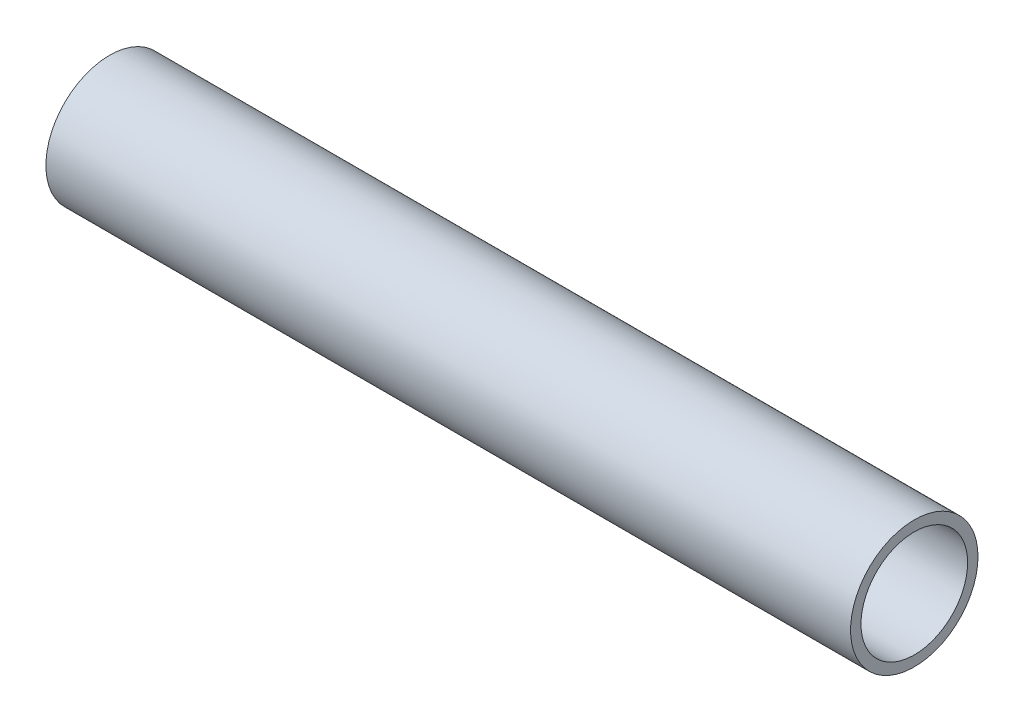
ISO-10303-21;
HEADER;
FILE_DESCRIPTION(('STEP AP214'),'2;1');
FILE_NAME('part.step','',(''),(''),'','','');
FILE_SCHEMA(('AUTOMOTIVE_DESIGN { 1 0 10303 214 1 1 1 1 }'));
ENDSEC;
DATA;
#1=APPLICATION_CONTEXT('core data for automotive mechanical design processes');
#2=APPLICATION_PROTOCOL_DEFINITION('international standard','automotive_design',2000,#1);
#3=PRODUCT_CONTEXT('',#1,'mechanical');
#4=PRODUCT('Part','Part','',(#3));
#5=PRODUCT_RELATED_PRODUCT_CATEGORY('part','',(#4));
#6=PRODUCT_DEFINITION_FORMATION('','',#4);
#7=PRODUCT_DEFINITION_CONTEXT('part definition',#1,'design');
#8=PRODUCT_DEFINITION('design','',#6,#7);
#9=PRODUCT_DEFINITION_SHAPE('','',#8);
#10=(LENGTH_UNIT() NAMED_UNIT(*) SI_UNIT(.MILLI.,.METRE.));
#11=(NAMED_UNIT(*) PLANE_ANGLE_UNIT() SI_UNIT($,.RADIAN.));
#12=(NAMED_UNIT(*) SI_UNIT($,.STERADIAN.) SOLID_ANGLE_UNIT());
#13=UNCERTAINTY_MEASURE_WITH_UNIT(LENGTH_MEASURE(1.E-05),#10,'distance_accuracy_value','');
#14=(GEOMETRIC_REPRESENTATION_CONTEXT(3) GLOBAL_UNCERTAINTY_ASSIGNED_CONTEXT((#13)) GLOBAL_UNIT_ASSIGNED_CONTEXT((#10,
#11,#12)) REPRESENTATION_CONTEXT('',''));
#15=CARTESIAN_POINT('',(0.,0.,0.));
#16=DIRECTION('',(0.,0.,1.));
#17=DIRECTION('',(1.,0.,0.));
#18=AXIS2_PLACEMENT_3D('',#15,#16,#17);
#19=CARTESIAN_POINT('',(304.8,0.,0.));
#20=DIRECTION('',(1.,0.,0.));
#21=DIRECTION('',(0.,0.,-1.));
#22=AXIS2_PLACEMENT_3D('',#19,#20,#21);
#23=PLANE('',#22);
#24=CARTESIAN_POINT('',(304.8,0.,0.));
#25=DIRECTION('',(1.,0.,0.));
#26=DIRECTION('',(0.,0.,-1.));
#27=AXIS2_PLACEMENT_3D('',#24,#25,#26);
#28=CIRCLE('',#27,24.13);
#29=CARTESIAN_POINT('',(304.8,0.,-24.13));
#30=VERTEX_POINT('',#29);
#31=EDGE_CURVE('E10',#30,#30,#28,.T.);
#32=ORIENTED_EDGE('',*,*,#31,.T.);
#33=EDGE_LOOP('',(#32));
#34=FACE_BOUND('',#33,.T.);
#35=CARTESIAN_POINT('',(304.8,0.,0.));
#36=DIRECTION('',(1.,0.,0.));
#37=DIRECTION('',(0.,0.,-1.));
#38=AXIS2_PLACEMENT_3D('',#35,#36,#37);
#39=CIRCLE('',#38,20.193);
#40=CARTESIAN_POINT('',(304.8,0.,-20.193));
#41=VERTEX_POINT('',#40);
#42=EDGE_CURVE('E42',#41,#41,#39,.T.);
#43=ORIENTED_EDGE('',*,*,#42,.F.);
#44=EDGE_LOOP('',(#43));
#45=FACE_BOUND('',#44,.T.);
#46=ADVANCED_FACE('F31',(#34,#45),#23,.T.);
#47=CARTESIAN_POINT('',(0.,0.,0.));
#48=DIRECTION('',(1.,0.,0.));
#49=DIRECTION('',(0.,0.,-1.));
#50=AXIS2_PLACEMENT_3D('',#47,#48,#49);
#51=PLANE('',#50);
#52=CARTESIAN_POINT('',(0.,0.,0.));
#53=DIRECTION('',(1.,0.,0.));
#54=DIRECTION('',(0.,0.,-1.));
#55=AXIS2_PLACEMENT_3D('',#52,#53,#54);
#56=CIRCLE('',#55,24.13);
#57=CARTESIAN_POINT('',(0.,0.,-24.13));
#58=VERTEX_POINT('',#57);
#59=EDGE_CURVE('E35',#58,#58,#56,.T.);
#60=ORIENTED_EDGE('',*,*,#59,.F.);
#61=EDGE_LOOP('',(#60));
#62=FACE_BOUND('',#61,.T.);
#63=CARTESIAN_POINT('',(0.,0.,0.));
#64=DIRECTION('',(1.,0.,0.));
#65=DIRECTION('',(0.,0.,-1.));
#66=AXIS2_PLACEMENT_3D('',#63,#64,#65);
#67=CIRCLE('',#66,20.193);
#68=CARTESIAN_POINT('',(0.,0.,-20.193));
#69=VERTEX_POINT('',#68);
#70=EDGE_CURVE('E44',#69,#69,#67,.T.);
#71=ORIENTED_EDGE('',*,*,#70,.T.);
#72=EDGE_LOOP('',(#71));
#73=FACE_BOUND('',#72,.T.);
#74=ADVANCED_FACE('F54',(#62,#73),#51,.F.);
#75=CARTESIAN_POINT('',(304.8,0.,0.));
#76=DIRECTION('',(-1.,0.,0.));
#77=DIRECTION('',(0.,0.,1.));
#78=AXIS2_PLACEMENT_3D('',#75,#76,#77);
#79=CYLINDRICAL_SURFACE('',#78,24.13);
#80=ORIENTED_EDGE('',*,*,#31,.F.);
#81=EDGE_LOOP('',(#80));
#82=FACE_BOUND('',#81,.T.);
#83=ORIENTED_EDGE('',*,*,#59,.T.);
#84=EDGE_LOOP('',(#83));
#85=FACE_BOUND('',#84,.T.);
#86=ADVANCED_FACE('F33',(#82,#85),#79,.T.);
#87=CARTESIAN_POINT('',(304.8,0.,0.));
#88=DIRECTION('',(-1.,0.,0.));
#89=DIRECTION('',(0.,0.,1.));
#90=AXIS2_PLACEMENT_3D('',#87,#88,#89);
#91=CYLINDRICAL_SURFACE('',#90,20.193);
#92=ORIENTED_EDGE('',*,*,#42,.T.);
#93=EDGE_LOOP('',(#92));
#94=FACE_BOUND('',#93,.T.);
#95=ORIENTED_EDGE('',*,*,#70,.F.);
#96=EDGE_LOOP('',(#95));
#97=FACE_BOUND('',#96,.T.);
#98=ADVANCED_FACE('F50',(#94,#97),#91,.F.);
#99=CLOSED_SHELL('',(#46,#74,#86,#98));
#100=MANIFOLD_SOLID_BREP('B2',#99);
#101=ADVANCED_BREP_SHAPE_REPRESENTATION('',(#18,#100),#14);
#102=SHAPE_DEFINITION_REPRESENTATION(#9,#101);
ENDSEC;
END-ISO-10303-21;
